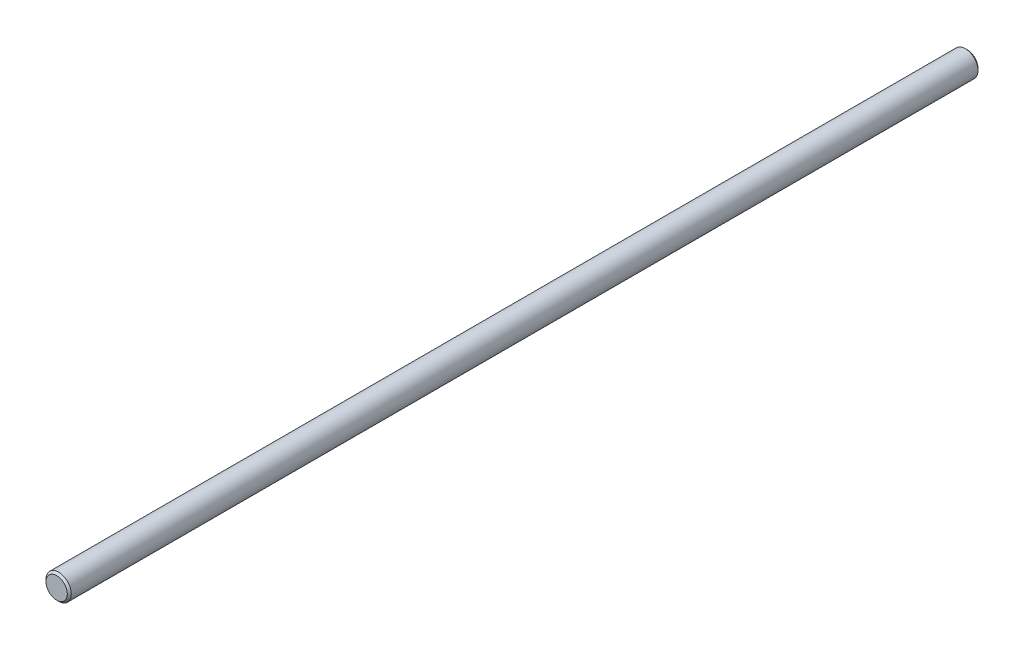
ISO-10303-21;
HEADER;
FILE_DESCRIPTION(('STEP AP214'),'2;1');
FILE_NAME('part.step','',(''),(''),'','','');
FILE_SCHEMA(('AUTOMOTIVE_DESIGN { 1 0 10303 214 1 1 1 1 }'));
ENDSEC;
DATA;
#1=APPLICATION_CONTEXT('core data for automotive mechanical design processes');
#2=APPLICATION_PROTOCOL_DEFINITION('international standard','automotive_design',2000,#1);
#3=PRODUCT_CONTEXT('',#1,'mechanical');
#4=PRODUCT('Part','Part','',(#3));
#5=PRODUCT_RELATED_PRODUCT_CATEGORY('part','',(#4));
#6=PRODUCT_DEFINITION_FORMATION('','',#4);
#7=PRODUCT_DEFINITION_CONTEXT('part definition',#1,'design');
#8=PRODUCT_DEFINITION('design','',#6,#7);
#9=PRODUCT_DEFINITION_SHAPE('','',#8);
#10=(LENGTH_UNIT() NAMED_UNIT(*) SI_UNIT(.MILLI.,.METRE.));
#11=(NAMED_UNIT(*) PLANE_ANGLE_UNIT() SI_UNIT($,.RADIAN.));
#12=(NAMED_UNIT(*) SI_UNIT($,.STERADIAN.) SOLID_ANGLE_UNIT());
#13=UNCERTAINTY_MEASURE_WITH_UNIT(LENGTH_MEASURE(1.E-05),#10,'distance_accuracy_value','');
#14=(GEOMETRIC_REPRESENTATION_CONTEXT(3) GLOBAL_UNCERTAINTY_ASSIGNED_CONTEXT((#13)) GLOBAL_UNIT_ASSIGNED_CONTEXT((#10,
#11,#12)) REPRESENTATION_CONTEXT('',''));
#15=CARTESIAN_POINT('',(0.,0.,0.));
#16=DIRECTION('',(0.,0.,1.));
#17=DIRECTION('',(1.,0.,0.));
#18=AXIS2_PLACEMENT_3D('',#15,#16,#17);
#19=CARTESIAN_POINT('',(0.,0.,228.6));
#20=DIRECTION('',(0.,0.,-1.));
#21=DIRECTION('',(-1.,0.,0.));
#22=AXIS2_PLACEMENT_3D('',#19,#20,#21);
#23=CYLINDRICAL_SURFACE('',#22,3.175);
#24=CARTESIAN_POINT('',(0.,0.,0.499999999999973));
#25=DIRECTION('',(0.,0.,1.));
#26=DIRECTION('',(1.,0.,0.));
#27=AXIS2_PLACEMENT_3D('',#24,#25,#26);
#28=CIRCLE('',#27,3.175);
#29=CARTESIAN_POINT('',(3.175,0.,0.499999999999973));
#30=VERTEX_POINT('',#29);
#31=EDGE_CURVE('E46',#30,#30,#28,.T.);
#32=ORIENTED_EDGE('',*,*,#31,.T.);
#33=EDGE_LOOP('',(#32));
#34=FACE_BOUND('',#33,.T.);
#35=CARTESIAN_POINT('',(0.,0.,228.1));
#36=DIRECTION('',(0.,0.,1.));
#37=DIRECTION('',(1.,0.,0.));
#38=AXIS2_PLACEMENT_3D('',#35,#36,#37);
#39=CIRCLE('',#38,3.175);
#40=CARTESIAN_POINT('',(3.175,0.,228.1));
#41=VERTEX_POINT('',#40);
#42=EDGE_CURVE('E51',#41,#41,#39,.F.);
#43=ORIENTED_EDGE('',*,*,#42,.T.);
#44=EDGE_LOOP('',(#43));
#45=FACE_BOUND('',#44,.T.);
#46=ADVANCED_FACE('F34',(#34,#45),#23,.T.);
#47=CARTESIAN_POINT('',(0.,0.,228.6));
#48=DIRECTION('',(0.,0.,1.));
#49=DIRECTION('',(1.,0.,0.));
#50=AXIS2_PLACEMENT_3D('',#47,#48,#49);
#51=PLANE('',#50);
#52=CARTESIAN_POINT('',(0.,0.,228.6));
#53=DIRECTION('',(0.,0.,1.));
#54=DIRECTION('',(1.,0.,0.));
#55=AXIS2_PLACEMENT_3D('',#52,#53,#54);
#56=CIRCLE('',#55,2.67499999999998);
#57=CARTESIAN_POINT('',(2.67499999999998,0.,228.6));
#58=VERTEX_POINT('',#57);
#59=EDGE_CURVE('E10',#58,#58,#56,.T.);
#60=ORIENTED_EDGE('',*,*,#59,.T.);
#61=EDGE_LOOP('',(#60));
#62=FACE_BOUND('',#61,.T.);
#63=ADVANCED_FACE('F67',(#62),#51,.T.);
#64=CARTESIAN_POINT('',(0.,0.,0.));
#65=DIRECTION('',(0.,0.,1.));
#66=DIRECTION('',(1.,0.,0.));
#67=AXIS2_PLACEMENT_3D('',#64,#65,#66);
#68=PLANE('',#67);
#69=CARTESIAN_POINT('',(0.,0.,0.));
#70=DIRECTION('',(0.,0.,1.));
#71=DIRECTION('',(1.,0.,0.));
#72=AXIS2_PLACEMENT_3D('',#69,#70,#71);
#73=CIRCLE('',#72,2.67500000000001);
#74=CARTESIAN_POINT('',(2.67500000000001,0.,0.));
#75=VERTEX_POINT('',#74);
#76=EDGE_CURVE('E41',#75,#75,#73,.F.);
#77=ORIENTED_EDGE('',*,*,#76,.T.);
#78=EDGE_LOOP('',(#77));
#79=FACE_BOUND('',#78,.T.);
#80=ADVANCED_FACE('F64',(#79),#68,.F.);
#81=CARTESIAN_POINT('',(0.,0.,0.499999999999973));
#82=DIRECTION('',(0.,0.,1.));
#83=DIRECTION('',(1.,0.,0.));
#84=AXIS2_PLACEMENT_3D('',#81,#82,#83);
#85=CONICAL_SURFACE('',#84,3.175,0.785398163397464);
#86=ORIENTED_EDGE('',*,*,#76,.F.);
#87=EDGE_LOOP('',(#86));
#88=FACE_BOUND('',#87,.T.);
#89=ORIENTED_EDGE('',*,*,#31,.F.);
#90=EDGE_LOOP('',(#89));
#91=FACE_BOUND('',#90,.T.);
#92=ADVANCED_FACE('F60',(#88,#91),#85,.T.);
#93=CARTESIAN_POINT('',(0.,0.,228.6));
#94=DIRECTION('',(0.,0.,-1.));
#95=DIRECTION('',(-1.,0.,0.));
#96=AXIS2_PLACEMENT_3D('',#93,#94,#95);
#97=CONICAL_SURFACE('',#96,2.67499999999998,0.785398163397464);
#98=ORIENTED_EDGE('',*,*,#42,.F.);
#99=EDGE_LOOP('',(#98));
#100=FACE_BOUND('',#99,.T.);
#101=ORIENTED_EDGE('',*,*,#59,.F.);
#102=EDGE_LOOP('',(#101));
#103=FACE_BOUND('',#102,.T.);
#104=ADVANCED_FACE('F36',(#100,#103),#97,.T.);
#105=CLOSED_SHELL('',(#46,#63,#80,#92,#104));
#106=MANIFOLD_SOLID_BREP('B2',#105);
#107=ADVANCED_BREP_SHAPE_REPRESENTATION('',(#18,#106),#14);
#108=SHAPE_DEFINITION_REPRESENTATION(#9,#107);
ENDSEC;
END-ISO-10303-21;
